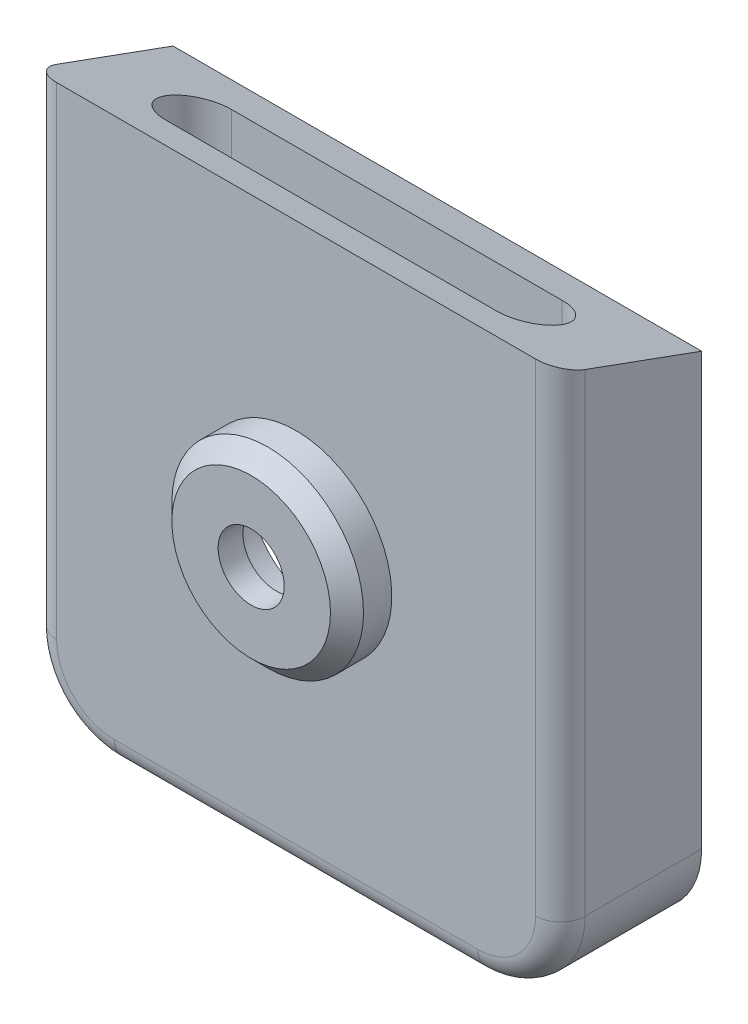
ISO-10303-21;
HEADER;
FILE_DESCRIPTION(('STEP AP214'),'2;1');
FILE_NAME('part.step','',(''),(''),'','','');
FILE_SCHEMA(('AUTOMOTIVE_DESIGN { 1 0 10303 214 1 1 1 1 }'));
ENDSEC;
DATA;
#1=APPLICATION_CONTEXT('core data for automotive mechanical design processes');
#2=APPLICATION_PROTOCOL_DEFINITION('international standard','automotive_design',2000,#1);
#3=PRODUCT_CONTEXT('',#1,'mechanical');
#4=PRODUCT('Part','Part','',(#3));
#5=PRODUCT_RELATED_PRODUCT_CATEGORY('part','',(#4));
#6=PRODUCT_DEFINITION_FORMATION('','',#4);
#7=PRODUCT_DEFINITION_CONTEXT('part definition',#1,'design');
#8=PRODUCT_DEFINITION('design','',#6,#7);
#9=PRODUCT_DEFINITION_SHAPE('','',#8);
#10=(LENGTH_UNIT() NAMED_UNIT(*) SI_UNIT(.MILLI.,.METRE.));
#11=(NAMED_UNIT(*) PLANE_ANGLE_UNIT() SI_UNIT($,.RADIAN.));
#12=(NAMED_UNIT(*) SI_UNIT($,.STERADIAN.) SOLID_ANGLE_UNIT());
#13=UNCERTAINTY_MEASURE_WITH_UNIT(LENGTH_MEASURE(1.E-05),#10,'distance_accuracy_value','');
#14=(GEOMETRIC_REPRESENTATION_CONTEXT(3) GLOBAL_UNCERTAINTY_ASSIGNED_CONTEXT((#13)) GLOBAL_UNIT_ASSIGNED_CONTEXT((#10,
#11,#12)) REPRESENTATION_CONTEXT('',''));
#15=CARTESIAN_POINT('',(0.,0.,0.));
#16=DIRECTION('',(0.,0.,1.));
#17=DIRECTION('',(1.,0.,0.));
#18=AXIS2_PLACEMENT_3D('',#15,#16,#17);
#19=CARTESIAN_POINT('',(0.,0.,0.));
#20=DIRECTION('',(0.,0.,-1.));
#21=DIRECTION('',(-1.,0.,0.));
#22=AXIS2_PLACEMENT_3D('',#19,#20,#21);
#23=PLANE('',#22);
#24=CARTESIAN_POINT('',(15.99167841418,17.4030955148981,0.));
#25=DIRECTION('',(0.,0.,-1.));
#26=DIRECTION('',(-1.,0.,0.));
#27=AXIS2_PLACEMENT_3D('',#24,#25,#26);
#28=CIRCLE('',#27,4.30000000001595);
#29=CARTESIAN_POINT('',(11.6916784141641,17.4030955148981,0.));
#30=VERTEX_POINT('',#29);
#31=EDGE_CURVE('E300',#30,#30,#28,.T.);
#32=ORIENTED_EDGE('',*,*,#31,.F.);
#33=EDGE_LOOP('',(#32));
#34=FACE_BOUND('',#33,.T.);
#35=DIRECTION('',(0.,1.,0.));
#36=VECTOR('',#35,1.);
#37=CARTESIAN_POINT('',(1.5,31.0919107027986,0.));
#38=LINE('',#37,#36);
#39=CARTESIAN_POINT('',(1.5,27.2919107027986,0.));
#40=VERTEX_POINT('',#39);
#41=CARTESIAN_POINT('',(1.5,5.,0.));
#42=VERTEX_POINT('',#41);
#43=EDGE_CURVE('E255',#40,#42,#38,.F.);
#44=ORIENTED_EDGE('',*,*,#43,.F.);
#45=CARTESIAN_POINT('',(3.5,27.2919107027986,0.));
#46=DIRECTION('',(0.,0.,-1.));
#47=DIRECTION('',(-1.,0.,0.));
#48=AXIS2_PLACEMENT_3D('',#45,#46,#47);
#49=CIRCLE('',#48,2.);
#50=CARTESIAN_POINT('',(3.5,29.2919107027986,0.));
#51=VERTEX_POINT('',#50);
#52=EDGE_CURVE('E326',#40,#51,#49,.T.);
#53=ORIENTED_EDGE('',*,*,#52,.T.);
#54=DIRECTION('',(-1.,0.,0.));
#55=VECTOR('',#54,1.);
#56=CARTESIAN_POINT('',(30.5,29.2919107027986,0.));
#57=LINE('',#56,#55);
#58=CARTESIAN_POINT('',(28.5,29.2919107027986,0.));
#59=VERTEX_POINT('',#58);
#60=EDGE_CURVE('E222',#59,#51,#57,.T.);
#61=ORIENTED_EDGE('',*,*,#60,.F.);
#62=CARTESIAN_POINT('',(28.5,27.2919107027986,0.));
#63=DIRECTION('',(0.,0.,-1.));
#64=DIRECTION('',(-1.,0.,0.));
#65=AXIS2_PLACEMENT_3D('',#62,#63,#64);
#66=CIRCLE('',#65,2.);
#67=CARTESIAN_POINT('',(30.5,27.2919107027986,0.));
#68=VERTEX_POINT('',#67);
#69=EDGE_CURVE('E324',#59,#68,#66,.T.);
#70=ORIENTED_EDGE('',*,*,#69,.T.);
#71=DIRECTION('',(0.,1.,0.));
#72=VECTOR('',#71,1.);
#73=CARTESIAN_POINT('',(30.5,5.,0.));
#74=LINE('',#73,#72);
#75=CARTESIAN_POINT('',(30.5,5.,0.));
#76=VERTEX_POINT('',#75);
#77=EDGE_CURVE('E240',#76,#68,#74,.T.);
#78=ORIENTED_EDGE('',*,*,#77,.F.);
#79=CARTESIAN_POINT('',(27.,5.,0.));
#80=DIRECTION('',(0.,0.,-1.));
#81=DIRECTION('',(-1.,0.,0.));
#82=AXIS2_PLACEMENT_3D('',#79,#80,#81);
#83=CIRCLE('',#82,3.5);
#84=CARTESIAN_POINT('',(27.,1.5,0.));
#85=VERTEX_POINT('',#84);
#86=EDGE_CURVE('E265',#85,#76,#83,.F.);
#87=ORIENTED_EDGE('',*,*,#86,.F.);
#88=DIRECTION('',(-1.,0.,0.));
#89=VECTOR('',#88,1.);
#90=CARTESIAN_POINT('',(5.,1.5,0.));
#91=LINE('',#90,#89);
#92=CARTESIAN_POINT('',(5.,1.5,0.));
#93=VERTEX_POINT('',#92);
#94=EDGE_CURVE('E270',#93,#85,#91,.F.);
#95=ORIENTED_EDGE('',*,*,#94,.F.);
#96=CARTESIAN_POINT('',(5.,5.,0.));
#97=DIRECTION('',(0.,0.,-1.));
#98=DIRECTION('',(-1.,0.,0.));
#99=AXIS2_PLACEMENT_3D('',#96,#97,#98);
#100=CIRCLE('',#99,3.5);
#101=EDGE_CURVE('E274',#42,#93,#100,.F.);
#102=ORIENTED_EDGE('',*,*,#101,.F.);
#103=EDGE_LOOP('',(#44,#53,#61,#70,#78,#87,#95,#102));
#104=FACE_BOUND('',#103,.T.);
#105=ADVANCED_FACE('F37',(#34,#104),#23,.T.);
#106=CARTESIAN_POINT('',(30.5,5.,-51.6673386829695));
#107=DIRECTION('',(1.,0.,0.));
#108=DIRECTION('',(0.,0.,-1.));
#109=AXIS2_PLACEMENT_3D('',#106,#107,#108);
#110=PLANE('',#109);
#111=ORIENTED_EDGE('',*,*,#77,.T.);
#112=DIRECTION('',(0.,0.,1.));
#113=VECTOR('',#112,1.);
#114=CARTESIAN_POINT('',(30.5,27.2919107027986,-7.05000000000003));
#115=LINE('',#114,#113);
#116=CARTESIAN_POINT('',(30.5,27.2919107027986,-7.05000000000003));
#117=VERTEX_POINT('',#116);
#118=EDGE_CURVE('E333',#68,#117,#115,.F.);
#119=ORIENTED_EDGE('',*,*,#118,.T.);
#120=DIRECTION('',(0.,1.,0.));
#121=VECTOR('',#120,1.);
#122=CARTESIAN_POINT('',(30.5,5.,-7.05000000000003));
#123=LINE('',#122,#121);
#124=CARTESIAN_POINT('',(30.5,4.99999999999989,-7.05000000000003));
#125=VERTEX_POINT('',#124);
#126=EDGE_CURVE('E268',#125,#117,#123,.T.);
#127=ORIENTED_EDGE('',*,*,#126,.F.);
#128=DIRECTION('',(0.,0.,1.));
#129=VECTOR('',#128,1.);
#130=CARTESIAN_POINT('',(30.5,5.,-51.6673386829695));
#131=LINE('',#130,#129);
#132=EDGE_CURVE('E235',#125,#76,#131,.T.);
#133=ORIENTED_EDGE('',*,*,#132,.T.);
#134=EDGE_LOOP('',(#111,#119,#127,#133));
#135=FACE_BOUND('',#134,.T.);
#136=ADVANCED_FACE('F432',(#135),#110,.F.);
#137=CARTESIAN_POINT('',(1.5,31.0919107027986,-51.6673386829695));
#138=DIRECTION('',(-1.,0.,0.));
#139=DIRECTION('',(0.,0.,1.));
#140=AXIS2_PLACEMENT_3D('',#137,#138,#139);
#141=PLANE('',#140);
#142=DIRECTION('',(0.,-1.,0.));
#143=VECTOR('',#142,1.);
#144=CARTESIAN_POINT('',(1.5,31.0919107027986,-7.05000000000003));
#145=LINE('',#144,#143);
#146=CARTESIAN_POINT('',(1.5,27.2919107027986,-7.05000000000003));
#147=VERTEX_POINT('',#146);
#148=CARTESIAN_POINT('',(1.50000000000003,4.99999999999989,-7.05000000000003));
#149=VERTEX_POINT('',#148);
#150=EDGE_CURVE('E259',#147,#149,#145,.T.);
#151=ORIENTED_EDGE('',*,*,#150,.F.);
#152=DIRECTION('',(0.,0.,1.));
#153=VECTOR('',#152,1.);
#154=CARTESIAN_POINT('',(1.5,27.2919107027986,0.));
#155=LINE('',#154,#153);
#156=EDGE_CURVE('E321',#147,#40,#155,.T.);
#157=ORIENTED_EDGE('',*,*,#156,.T.);
#158=ORIENTED_EDGE('',*,*,#43,.T.);
#159=DIRECTION('',(0.,0.,1.));
#160=VECTOR('',#159,1.);
#161=CARTESIAN_POINT('',(1.5,5.,-51.6673386829695));
#162=LINE('',#161,#160);
#163=EDGE_CURVE('E277',#149,#42,#162,.T.);
#164=ORIENTED_EDGE('',*,*,#163,.F.);
#165=EDGE_LOOP('',(#151,#157,#158,#164));
#166=FACE_BOUND('',#165,.T.);
#167=ADVANCED_FACE('F428',(#166),#141,.F.);
#168=CARTESIAN_POINT('',(0.,0.,1.5));
#169=DIRECTION('',(0.,0.,-1.));
#170=DIRECTION('',(-1.,0.,0.));
#171=AXIS2_PLACEMENT_3D('',#168,#169,#170);
#172=PLANE('',#171);
#173=DIRECTION('',(1.,0.,0.));
#174=VECTOR('',#173,1.);
#175=CARTESIAN_POINT('',(-9.09871995466946,34.2038562057746,1.5));
#176=LINE('',#175,#174);
#177=CARTESIAN_POINT('',(1.5,34.2038562057746,1.5));
#178=VERTEX_POINT('',#177);
#179=CARTESIAN_POINT('',(30.5,34.2038562057746,1.5));
#180=VERTEX_POINT('',#179);
#181=EDGE_CURVE('E230',#178,#180,#176,.T.);
#182=ORIENTED_EDGE('',*,*,#181,.F.);
#183=DIRECTION('',(0.,-1.,0.));
#184=VECTOR('',#183,1.);
#185=CARTESIAN_POINT('',(1.5,0.,1.5));
#186=LINE('',#185,#184);
#187=CARTESIAN_POINT('',(1.5,5.,1.5));
#188=VERTEX_POINT('',#187);
#189=EDGE_CURVE('E347',#178,#188,#186,.T.);
#190=ORIENTED_EDGE('',*,*,#189,.T.);
#191=CARTESIAN_POINT('',(5.,5.,1.5));
#192=DIRECTION('',(0.,0.,-1.));
#193=DIRECTION('',(-1.,0.,0.));
#194=AXIS2_PLACEMENT_3D('',#191,#192,#193);
#195=CIRCLE('',#194,3.5);
#196=CARTESIAN_POINT('',(5.,1.5,1.5));
#197=VERTEX_POINT('',#196);
#198=EDGE_CURVE('E345',#188,#197,#195,.F.);
#199=ORIENTED_EDGE('',*,*,#198,.T.);
#200=DIRECTION('',(1.,0.,0.));
#201=VECTOR('',#200,1.);
#202=CARTESIAN_POINT('',(0.,1.5,1.5));
#203=LINE('',#202,#201);
#204=CARTESIAN_POINT('',(27.,1.5,1.5));
#205=VERTEX_POINT('',#204);
#206=EDGE_CURVE('E343',#197,#205,#203,.T.);
#207=ORIENTED_EDGE('',*,*,#206,.T.);
#208=CARTESIAN_POINT('',(27.,5.,1.5));
#209=DIRECTION('',(0.,0.,-1.));
#210=DIRECTION('',(-1.,0.,0.));
#211=AXIS2_PLACEMENT_3D('',#208,#209,#210);
#212=CIRCLE('',#211,3.5);
#213=CARTESIAN_POINT('',(30.5,5.,1.5));
#214=VERTEX_POINT('',#213);
#215=EDGE_CURVE('E341',#205,#214,#212,.F.);
#216=ORIENTED_EDGE('',*,*,#215,.T.);
#217=DIRECTION('',(0.,1.,0.));
#218=VECTOR('',#217,1.);
#219=CARTESIAN_POINT('',(30.5,0.,1.5));
#220=LINE('',#219,#218);
#221=EDGE_CURVE('E339',#214,#180,#220,.T.);
#222=ORIENTED_EDGE('',*,*,#221,.T.);
#223=EDGE_LOOP('',(#182,#190,#199,#207,#216,#222));
#224=FACE_BOUND('',#223,.T.);
#225=CARTESIAN_POINT('',(15.99167841418,17.4030955148981,1.5));
#226=DIRECTION('',(0.,0.,-1.));
#227=DIRECTION('',(-1.,0.,0.));
#228=AXIS2_PLACEMENT_3D('',#225,#226,#227);
#229=CIRCLE('',#228,5.79999999998862);
#230=CARTESIAN_POINT('',(10.1916784141914,17.4030955148981,1.5));
#231=VERTEX_POINT('',#230);
#232=EDGE_CURVE('E312',#231,#231,#229,.F.);
#233=ORIENTED_EDGE('',*,*,#232,.F.);
#234=EDGE_LOOP('',(#233));
#235=FACE_BOUND('',#234,.T.);
#236=ADVANCED_FACE('F401',(#224,#235),#172,.F.);
#237=CARTESIAN_POINT('',(0.,0.,1.5));
#238=DIRECTION('',(1.,0.,0.));
#239=DIRECTION('',(0.,0.,-1.));
#240=AXIS2_PLACEMENT_3D('',#237,#238,#239);
#241=PLANE('',#240);
#242=DIRECTION('',(0.,0.,-1.));
#243=VECTOR('',#242,1.);
#244=CARTESIAN_POINT('',(0.,5.,1.5));
#245=LINE('',#244,#243);
#246=CARTESIAN_POINT('',(0.,4.99999999999989,-7.05000000000003));
#247=VERTEX_POINT('',#246);
#248=CARTESIAN_POINT('',(0.,5.,0.));
#249=VERTEX_POINT('',#248);
#250=EDGE_CURVE('E309',#247,#249,#245,.F.);
#251=ORIENTED_EDGE('',*,*,#250,.T.);
#252=DIRECTION('',(0.,-1.,0.));
#253=VECTOR('',#252,1.);
#254=CARTESIAN_POINT('',(0.,0.,0.));
#255=LINE('',#254,#253);
#256=CARTESIAN_POINT('',(0.,33.6579008543753,0.));
#257=VERTEX_POINT('',#256);
#258=EDGE_CURVE('E350',#249,#257,#255,.F.);
#259=ORIENTED_EDGE('',*,*,#258,.T.);
#260=DIRECTION('',(0.,-0.342020143325631,-0.939692620785922));
#261=VECTOR('',#260,1.);
#262=CARTESIAN_POINT('',(0.,31.0919107027987,-7.05000000000045));
#263=LINE('',#262,#261);
#264=CARTESIAN_POINT('',(0.,31.0919107027987,-7.05000000000045));
#265=VERTEX_POINT('',#264);
#266=EDGE_CURVE('E233',#257,#265,#263,.T.);
#267=ORIENTED_EDGE('',*,*,#266,.T.);
#268=DIRECTION('',(0.,-1.,0.));
#269=VECTOR('',#268,1.);
#270=CARTESIAN_POINT('',(0.,31.0919107027986,-7.05000000000003));
#271=LINE('',#270,#269);
#272=EDGE_CURVE('E252',#265,#247,#271,.T.);
#273=ORIENTED_EDGE('',*,*,#272,.T.);
#274=EDGE_LOOP('',(#251,#259,#267,#273));
#275=FACE_BOUND('',#274,.T.);
#276=ADVANCED_FACE('F419',(#275),#241,.F.);
#277=CARTESIAN_POINT('',(0.,0.,1.5));
#278=DIRECTION('',(0.,1.,0.));
#279=DIRECTION('',(0.,0.,1.));
#280=AXIS2_PLACEMENT_3D('',#277,#278,#279);
#281=PLANE('',#280);
#282=DIRECTION('',(0.,0.,-1.));
#283=VECTOR('',#282,1.);
#284=CARTESIAN_POINT('',(27.,0.,1.5));
#285=LINE('',#284,#283);
#286=CARTESIAN_POINT('',(27.,-1.11022302462516E-13,-7.05000000000003));
#287=VERTEX_POINT('',#286);
#288=CARTESIAN_POINT('',(27.,0.,0.));
#289=VERTEX_POINT('',#288);
#290=EDGE_CURVE('E307',#287,#289,#285,.F.);
#291=ORIENTED_EDGE('',*,*,#290,.T.);
#292=DIRECTION('',(1.,0.,0.));
#293=VECTOR('',#292,1.);
#294=CARTESIAN_POINT('',(0.,0.,0.));
#295=LINE('',#294,#293);
#296=CARTESIAN_POINT('',(5.,0.,0.));
#297=VERTEX_POINT('',#296);
#298=EDGE_CURVE('E358',#289,#297,#295,.F.);
#299=ORIENTED_EDGE('',*,*,#298,.T.);
#300=DIRECTION('',(0.,0.,-1.));
#301=VECTOR('',#300,1.);
#302=CARTESIAN_POINT('',(5.,0.,1.5));
#303=LINE('',#302,#301);
#304=CARTESIAN_POINT('',(5.00000000000003,-1.11022302462516E-13,-7.05000000000003));
#305=VERTEX_POINT('',#304);
#306=EDGE_CURVE('E305',#297,#305,#303,.T.);
#307=ORIENTED_EDGE('',*,*,#306,.T.);
#308=DIRECTION('',(1.,0.,0.));
#309=VECTOR('',#308,1.);
#310=CARTESIAN_POINT('',(5.,0.,-7.05000000000003));
#311=LINE('',#310,#309);
#312=EDGE_CURVE('E246',#305,#287,#311,.T.);
#313=ORIENTED_EDGE('',*,*,#312,.T.);
#314=EDGE_LOOP('',(#291,#299,#307,#313));
#315=FACE_BOUND('',#314,.T.);
#316=ADVANCED_FACE('F412',(#315),#281,.F.);
#317=CARTESIAN_POINT('',(32.,0.,1.5));
#318=DIRECTION('',(-1.,0.,0.));
#319=DIRECTION('',(0.,0.,1.));
#320=AXIS2_PLACEMENT_3D('',#317,#318,#319);
#321=PLANE('',#320);
#322=DIRECTION('',(0.,0.342020143325631,0.939692620785922));
#323=VECTOR('',#322,1.);
#324=CARTESIAN_POINT('',(32.,31.0919107027987,-7.05000000000045));
#325=LINE('',#324,#323);
#326=CARTESIAN_POINT('',(32.,31.0919107027987,-7.05000000000045));
#327=VERTEX_POINT('',#326);
#328=CARTESIAN_POINT('',(32.,33.6579008543753,0.));
#329=VERTEX_POINT('',#328);
#330=EDGE_CURVE('E228',#327,#329,#325,.T.);
#331=ORIENTED_EDGE('',*,*,#330,.T.);
#332=DIRECTION('',(0.,1.,0.));
#333=VECTOR('',#332,1.);
#334=CARTESIAN_POINT('',(32.,0.,0.));
#335=LINE('',#334,#333);
#336=CARTESIAN_POINT('',(32.,5.,0.));
#337=VERTEX_POINT('',#336);
#338=EDGE_CURVE('E11',#329,#337,#335,.F.);
#339=ORIENTED_EDGE('',*,*,#338,.T.);
#340=DIRECTION('',(0.,0.,-1.));
#341=VECTOR('',#340,1.);
#342=CARTESIAN_POINT('',(32.,5.,1.5));
#343=LINE('',#342,#341);
#344=CARTESIAN_POINT('',(32.,4.99999999999989,-7.05000000000003));
#345=VERTEX_POINT('',#344);
#346=EDGE_CURVE('E303',#337,#345,#343,.T.);
#347=ORIENTED_EDGE('',*,*,#346,.T.);
#348=DIRECTION('',(0.,1.,0.));
#349=VECTOR('',#348,1.);
#350=CARTESIAN_POINT('',(32.,5.,-7.05000000000003));
#351=LINE('',#350,#349);
#352=EDGE_CURVE('E239',#345,#327,#351,.T.);
#353=ORIENTED_EDGE('',*,*,#352,.T.);
#354=EDGE_LOOP('',(#331,#339,#347,#353));
#355=FACE_BOUND('',#354,.T.);
#356=ADVANCED_FACE('F426',(#355),#321,.F.);
#357=CARTESIAN_POINT('',(27.,5.,1.5));
#358=DIRECTION('',(0.,0.,-1.));
#359=DIRECTION('',(-1.,0.,0.));
#360=AXIS2_PLACEMENT_3D('',#357,#358,#359);
#361=CYLINDRICAL_SURFACE('',#360,5.);
#362=ORIENTED_EDGE('',*,*,#346,.F.);
#363=CARTESIAN_POINT('',(27.,5.,0.));
#364=DIRECTION('',(0.,0.,-1.));
#365=DIRECTION('',(-1.,0.,0.));
#366=AXIS2_PLACEMENT_3D('',#363,#364,#365);
#367=CIRCLE('',#366,5.);
#368=EDGE_CURVE('E46',#337,#289,#367,.T.);
#369=ORIENTED_EDGE('',*,*,#368,.T.);
#370=ORIENTED_EDGE('',*,*,#290,.F.);
#371=CARTESIAN_POINT('',(27.,5.,-7.05000000000003));
#372=DIRECTION('',(0.,0.,-1.));
#373=DIRECTION('',(-1.,0.,0.));
#374=AXIS2_PLACEMENT_3D('',#371,#372,#373);
#375=CIRCLE('',#374,5.);
#376=EDGE_CURVE('E243',#287,#345,#375,.F.);
#377=ORIENTED_EDGE('',*,*,#376,.T.);
#378=EDGE_LOOP('',(#362,#369,#370,#377));
#379=FACE_BOUND('',#378,.T.);
#380=ADVANCED_FACE('F445',(#379),#361,.T.);
#381=CARTESIAN_POINT('',(5.,5.,1.5));
#382=DIRECTION('',(0.,0.,-1.));
#383=DIRECTION('',(-1.,0.,0.));
#384=AXIS2_PLACEMENT_3D('',#381,#382,#383);
#385=CYLINDRICAL_SURFACE('',#384,5.);
#386=ORIENTED_EDGE('',*,*,#306,.F.);
#387=CARTESIAN_POINT('',(5.,5.,0.));
#388=DIRECTION('',(0.,0.,-1.));
#389=DIRECTION('',(-1.,0.,0.));
#390=AXIS2_PLACEMENT_3D('',#387,#388,#389);
#391=CIRCLE('',#390,5.);
#392=EDGE_CURVE('E356',#297,#249,#391,.T.);
#393=ORIENTED_EDGE('',*,*,#392,.T.);
#394=ORIENTED_EDGE('',*,*,#250,.F.);
#395=CARTESIAN_POINT('',(5.,5.,-7.05000000000003));
#396=DIRECTION('',(0.,0.,-1.));
#397=DIRECTION('',(-1.,0.,0.));
#398=AXIS2_PLACEMENT_3D('',#395,#396,#397);
#399=CIRCLE('',#398,5.);
#400=EDGE_CURVE('E249',#247,#305,#399,.F.);
#401=ORIENTED_EDGE('',*,*,#400,.T.);
#402=EDGE_LOOP('',(#386,#393,#394,#401));
#403=FACE_BOUND('',#402,.T.);
#404=ADVANCED_FACE('F415',(#403),#385,.T.);
#405=CARTESIAN_POINT('',(15.99167841418,17.4030955148981,1.5));
#406=DIRECTION('',(0.,0.,-1.));
#407=DIRECTION('',(-1.,0.,0.));
#408=AXIS2_PLACEMENT_3D('',#405,#406,#407);
#409=CYLINDRICAL_SURFACE('',#408,4.30000000001595);
#410=ORIENTED_EDGE('',*,*,#31,.T.);
#411=EDGE_LOOP('',(#410));
#412=FACE_BOUND('',#411,.T.);
#413=CARTESIAN_POINT('',(15.99167841418,17.4030955148981,2.7129998678795));
#414=DIRECTION('',(0.,0.,-1.));
#415=DIRECTION('',(-1.,0.,0.));
#416=AXIS2_PLACEMENT_3D('',#413,#414,#415);
#417=CIRCLE('',#416,4.29999999999419);
#418=CARTESIAN_POINT('',(11.6916784141858,17.4030955148981,2.7129998678795));
#419=VERTEX_POINT('',#418);
#420=EDGE_CURVE('E295',#419,#419,#417,.T.);
#421=ORIENTED_EDGE('',*,*,#420,.F.);
#422=EDGE_LOOP('',(#421));
#423=FACE_BOUND('',#422,.T.);
#424=ADVANCED_FACE('F453',(#412,#423),#409,.F.);
#425=CARTESIAN_POINT('',(15.99167841418,17.4030955148981,19.1178771913752));
#426=DIRECTION('',(0.,0.,-1.));
#427=DIRECTION('',(-1.,0.,0.));
#428=AXIS2_PLACEMENT_3D('',#425,#426,#427);
#429=CYLINDRICAL_SURFACE('',#428,5.79999999998862);
#430=CARTESIAN_POINT('',(15.99167841418,17.4030955148981,3.21299986788507));
#431=DIRECTION('',(0.,0.,1.));
#432=DIRECTION('',(1.,0.,0.));
#433=AXIS2_PLACEMENT_3D('',#430,#431,#432);
#434=CIRCLE('',#433,5.79999999998862);
#435=CARTESIAN_POINT('',(21.7916784141686,17.4030955148981,3.21299986788507));
#436=VERTEX_POINT('',#435);
#437=EDGE_CURVE('E318',#436,#436,#434,.F.);
#438=ORIENTED_EDGE('',*,*,#437,.T.);
#439=EDGE_LOOP('',(#438));
#440=FACE_BOUND('',#439,.T.);
#441=ORIENTED_EDGE('',*,*,#232,.T.);
#442=EDGE_LOOP('',(#441));
#443=FACE_BOUND('',#442,.T.);
#444=ADVANCED_FACE('F522',(#440,#443),#429,.T.);
#445=CARTESIAN_POINT('',(15.99167841418,17.4030955148981,2.7129998678795));
#446=DIRECTION('',(0.,0.,1.));
#447=DIRECTION('',(1.,0.,0.));
#448=AXIS2_PLACEMENT_3D('',#445,#446,#447);
#449=PLANE('',#448);
#450=CARTESIAN_POINT('',(15.99167841418,17.4030955148981,2.7129998678795));
#451=DIRECTION('',(0.,0.,1.));
#452=DIRECTION('',(1.,0.,0.));
#453=AXIS2_PLACEMENT_3D('',#450,#451,#452);
#454=CIRCLE('',#453,1.99999999999419);
#455=CARTESIAN_POINT('',(17.9916784141742,17.4030955148981,2.7129998678795));
#456=VERTEX_POINT('',#455);
#457=EDGE_CURVE('E264',#456,#456,#454,.T.);
#458=ORIENTED_EDGE('',*,*,#457,.T.);
#459=EDGE_LOOP('',(#458));
#460=FACE_BOUND('',#459,.T.);
#461=ORIENTED_EDGE('',*,*,#420,.T.);
#462=EDGE_LOOP('',(#461));
#463=FACE_BOUND('',#462,.T.);
#464=ADVANCED_FACE('F518',(#460,#463),#449,.F.);
#465=CARTESIAN_POINT('',(15.99167841418,17.4030955148981,4.2129998678795));
#466=DIRECTION('',(0.,0.,1.));
#467=DIRECTION('',(1.,0.,0.));
#468=AXIS2_PLACEMENT_3D('',#465,#466,#467);
#469=PLANE('',#468);
#470=CARTESIAN_POINT('',(15.99167841418,17.4030955148981,4.2129998678795));
#471=DIRECTION('',(0.,0.,1.));
#472=DIRECTION('',(1.,0.,0.));
#473=AXIS2_PLACEMENT_3D('',#470,#471,#472);
#474=CIRCLE('',#473,4.79999999999419);
#475=CARTESIAN_POINT('',(20.7916784141742,17.4030955148981,4.2129998678795));
#476=VERTEX_POINT('',#475);
#477=EDGE_CURVE('E315',#476,#476,#474,.T.);
#478=ORIENTED_EDGE('',*,*,#477,.T.);
#479=EDGE_LOOP('',(#478));
#480=FACE_BOUND('',#479,.T.);
#481=CARTESIAN_POINT('',(15.99167841418,17.4030955148981,4.2129998678795));
#482=DIRECTION('',(0.,0.,1.));
#483=DIRECTION('',(1.,0.,0.));
#484=AXIS2_PLACEMENT_3D('',#481,#482,#483);
#485=CIRCLE('',#484,1.99999999999419);
#486=CARTESIAN_POINT('',(17.9916784141742,17.4030955148981,4.2129998678795));
#487=VERTEX_POINT('',#486);
#488=EDGE_CURVE('E292',#487,#487,#485,.T.);
#489=ORIENTED_EDGE('',*,*,#488,.F.);
#490=EDGE_LOOP('',(#489));
#491=FACE_BOUND('',#490,.T.);
#492=ADVANCED_FACE('F514',(#480,#491),#469,.T.);
#493=CARTESIAN_POINT('',(15.99167841418,17.4030955148981,4.2129998678795));
#494=DIRECTION('',(0.,0.,-1.));
#495=DIRECTION('',(-1.,0.,0.));
#496=AXIS2_PLACEMENT_3D('',#493,#494,#495);
#497=CYLINDRICAL_SURFACE('',#496,1.99999999999419);
#498=ORIENTED_EDGE('',*,*,#488,.T.);
#499=EDGE_LOOP('',(#498));
#500=FACE_BOUND('',#499,.T.);
#501=ORIENTED_EDGE('',*,*,#457,.F.);
#502=EDGE_LOOP('',(#501));
#503=FACE_BOUND('',#502,.T.);
#504=ADVANCED_FACE('F460',(#500,#503),#497,.F.);
#505=CARTESIAN_POINT('',(15.99167841418,17.4030955148981,4.2129998678795));
#506=DIRECTION('',(0.,0.,-1.));
#507=DIRECTION('',(-1.,0.,0.));
#508=AXIS2_PLACEMENT_3D('',#505,#506,#507);
#509=CONICAL_SURFACE('',#508,4.79999999999419,0.78539816339745);
#510=ORIENTED_EDGE('',*,*,#437,.F.);
#511=EDGE_LOOP('',(#510));
#512=FACE_BOUND('',#511,.T.);
#513=ORIENTED_EDGE('',*,*,#477,.F.);
#514=EDGE_LOOP('',(#513));
#515=FACE_BOUND('',#514,.T.);
#516=ADVANCED_FACE('F456',(#512,#515),#509,.T.);
#517=CARTESIAN_POINT('',(5.,5.,-51.6673386829695));
#518=DIRECTION('',(0.,0.,1.));
#519=DIRECTION('',(1.,0.,0.));
#520=AXIS2_PLACEMENT_3D('',#517,#518,#519);
#521=CYLINDRICAL_SURFACE('',#520,3.5);
#522=CARTESIAN_POINT('',(5.,5.,-7.05000000000003));
#523=DIRECTION('',(0.,0.,-1.));
#524=DIRECTION('',(-1.,0.,0.));
#525=AXIS2_PLACEMENT_3D('',#522,#523,#524);
#526=CIRCLE('',#525,3.5);
#527=CARTESIAN_POINT('',(5.00000000000003,1.49999999999989,-7.05000000000003));
#528=VERTEX_POINT('',#527);
#529=EDGE_CURVE('E256',#149,#528,#526,.F.);
#530=ORIENTED_EDGE('',*,*,#529,.F.);
#531=ORIENTED_EDGE('',*,*,#163,.T.);
#532=ORIENTED_EDGE('',*,*,#101,.T.);
#533=DIRECTION('',(0.,0.,1.));
#534=VECTOR('',#533,1.);
#535=CARTESIAN_POINT('',(5.,1.5,-51.6673386829695));
#536=LINE('',#535,#534);
#537=EDGE_CURVE('E273',#528,#93,#536,.T.);
#538=ORIENTED_EDGE('',*,*,#537,.F.);
#539=EDGE_LOOP('',(#530,#531,#532,#538));
#540=FACE_BOUND('',#539,.T.);
#541=ADVANCED_FACE('F459',(#540),#521,.F.);
#542=CARTESIAN_POINT('',(5.,1.5,-51.6673386829695));
#543=DIRECTION('',(0.,-1.,0.));
#544=DIRECTION('',(0.,0.,-1.));
#545=AXIS2_PLACEMENT_3D('',#542,#543,#544);
#546=PLANE('',#545);
#547=DIRECTION('',(1.,0.,0.));
#548=VECTOR('',#547,1.);
#549=CARTESIAN_POINT('',(5.,1.5,-7.05000000000003));
#550=LINE('',#549,#548);
#551=CARTESIAN_POINT('',(27.,1.5,-7.05000000000003));
#552=VERTEX_POINT('',#551);
#553=EDGE_CURVE('E258',#528,#552,#550,.T.);
#554=ORIENTED_EDGE('',*,*,#553,.F.);
#555=ORIENTED_EDGE('',*,*,#537,.T.);
#556=ORIENTED_EDGE('',*,*,#94,.T.);
#557=DIRECTION('',(0.,0.,1.));
#558=VECTOR('',#557,1.);
#559=CARTESIAN_POINT('',(27.,1.5,-51.6673386829695));
#560=LINE('',#559,#558);
#561=EDGE_CURVE('E269',#552,#85,#560,.T.);
#562=ORIENTED_EDGE('',*,*,#561,.F.);
#563=EDGE_LOOP('',(#554,#555,#556,#562));
#564=FACE_BOUND('',#563,.T.);
#565=ADVANCED_FACE('F498',(#564),#546,.F.);
#566=CARTESIAN_POINT('',(27.,5.,-51.6673386829695));
#567=DIRECTION('',(0.,0.,1.));
#568=DIRECTION('',(1.,0.,0.));
#569=AXIS2_PLACEMENT_3D('',#566,#567,#568);
#570=CYLINDRICAL_SURFACE('',#569,3.5);
#571=CARTESIAN_POINT('',(27.,5.,-7.05000000000003));
#572=DIRECTION('',(0.,0.,-1.));
#573=DIRECTION('',(-1.,0.,0.));
#574=AXIS2_PLACEMENT_3D('',#571,#572,#573);
#575=CIRCLE('',#574,3.5);
#576=EDGE_CURVE('E261',#552,#125,#575,.F.);
#577=ORIENTED_EDGE('',*,*,#576,.F.);
#578=ORIENTED_EDGE('',*,*,#561,.T.);
#579=ORIENTED_EDGE('',*,*,#86,.T.);
#580=ORIENTED_EDGE('',*,*,#132,.F.);
#581=EDGE_LOOP('',(#577,#578,#579,#580));
#582=FACE_BOUND('',#581,.T.);
#583=ADVANCED_FACE('F495',(#582),#570,.F.);
#584=CARTESIAN_POINT('',(32.,29.9999999999999,-7.05000000000003));
#585=DIRECTION('',(0.,0.,-1.));
#586=DIRECTION('',(1.,0.,0.));
#587=AXIS2_PLACEMENT_3D('',#584,#585,#586);
#588=PLANE('',#587);
#589=ORIENTED_EDGE('',*,*,#126,.T.);
#590=CARTESIAN_POINT('',(28.5,27.2919107027986,-7.05000000000003));
#591=DIRECTION('',(0.,0.,-1.));
#592=DIRECTION('',(-1.,0.,0.));
#593=AXIS2_PLACEMENT_3D('',#590,#591,#592);
#594=CIRCLE('',#593,2.);
#595=CARTESIAN_POINT('',(28.5,29.2919107027986,-7.05000000000003));
#596=VERTEX_POINT('',#595);
#597=EDGE_CURVE('E337',#117,#596,#594,.F.);
#598=ORIENTED_EDGE('',*,*,#597,.T.);
#599=DIRECTION('',(-1.,0.,0.));
#600=VECTOR('',#599,1.);
#601=CARTESIAN_POINT('',(30.5,29.2919107027986,-7.05000000000003));
#602=LINE('',#601,#600);
#603=CARTESIAN_POINT('',(3.5,29.2919107027986,-7.05000000000003));
#604=VERTEX_POINT('',#603);
#605=EDGE_CURVE('E225',#596,#604,#602,.T.);
#606=ORIENTED_EDGE('',*,*,#605,.T.);
#607=CARTESIAN_POINT('',(3.5,27.2919107027986,-7.05000000000003));
#608=DIRECTION('',(0.,0.,-1.));
#609=DIRECTION('',(-1.,0.,0.));
#610=AXIS2_PLACEMENT_3D('',#607,#608,#609);
#611=CIRCLE('',#610,2.);
#612=EDGE_CURVE('E335',#604,#147,#611,.F.);
#613=ORIENTED_EDGE('',*,*,#612,.T.);
#614=ORIENTED_EDGE('',*,*,#150,.T.);
#615=ORIENTED_EDGE('',*,*,#529,.T.);
#616=ORIENTED_EDGE('',*,*,#553,.T.);
#617=ORIENTED_EDGE('',*,*,#576,.T.);
#618=EDGE_LOOP('',(#589,#598,#606,#613,#614,#615,#616,#617));
#619=FACE_BOUND('',#618,.T.);
#620=ORIENTED_EDGE('',*,*,#272,.F.);
#621=DIRECTION('',(-1.,0.,0.));
#622=VECTOR('',#621,1.);
#623=CARTESIAN_POINT('',(32.,31.0919107027986,-7.05000000000003));
#624=LINE('',#623,#622);
#625=EDGE_CURVE('E236',#327,#265,#624,.T.);
#626=ORIENTED_EDGE('',*,*,#625,.F.);
#627=ORIENTED_EDGE('',*,*,#352,.F.);
#628=ORIENTED_EDGE('',*,*,#376,.F.);
#629=ORIENTED_EDGE('',*,*,#312,.F.);
#630=ORIENTED_EDGE('',*,*,#400,.F.);
#631=EDGE_LOOP('',(#620,#626,#627,#628,#629,#630));
#632=FACE_BOUND('',#631,.T.);
#633=ADVANCED_FACE('F386',(#619,#632),#588,.T.);
#634=CARTESIAN_POINT('',(-9.09871995466946,31.0919107027987,-7.05000000000045));
#635=DIRECTION('',(0.,0.939692620785922,-0.342020143325631));
#636=DIRECTION('',(0.,0.342020143325631,0.939692620785922));
#637=AXIS2_PLACEMENT_3D('',#634,#635,#636);
#638=PLANE('',#637);
#639=CARTESIAN_POINT('',(26.,32.7115782452833,-2.6));
#640=DIRECTION('',(0.,0.939692620785922,-0.342020143325631));
#641=DIRECTION('',(0.,-0.342020143325631,-0.939692620785922));
#642=AXIS2_PLACEMENT_3D('',#639,#640,#641);
#643=ELLIPSE('',#642,2.12835554495179,2.);
#644=CARTESIAN_POINT('',(26.,33.4395187138156,-0.6));
#645=VERTEX_POINT('',#644);
#646=CARTESIAN_POINT('',(26.,31.983637776751,-4.6));
#647=VERTEX_POINT('',#646);
#648=EDGE_CURVE('E220',#645,#647,#643,.T.);
#649=ORIENTED_EDGE('',*,*,#648,.F.);
#650=DIRECTION('',(1.,0.,0.));
#651=VECTOR('',#650,1.);
#652=CARTESIAN_POINT('',(-9.09871995466946,33.4395187138156,-0.600000000000004));
#653=LINE('',#652,#651);
#654=CARTESIAN_POINT('',(6.,33.4395187138156,-0.600000000000002));
#655=VERTEX_POINT('',#654);
#656=EDGE_CURVE('E213',#655,#645,#653,.T.);
#657=ORIENTED_EDGE('',*,*,#656,.F.);
#658=CARTESIAN_POINT('',(6.,32.7115782452833,-2.6));
#659=DIRECTION('',(0.,0.939692620785922,-0.342020143325631));
#660=DIRECTION('',(0.,-0.342020143325631,-0.939692620785922));
#661=AXIS2_PLACEMENT_3D('',#658,#659,#660);
#662=ELLIPSE('',#661,2.12835554495179,2.);
#663=CARTESIAN_POINT('',(6.,31.983637776751,-4.6));
#664=VERTEX_POINT('',#663);
#665=EDGE_CURVE('E188',#664,#655,#662,.T.);
#666=ORIENTED_EDGE('',*,*,#665,.F.);
#667=DIRECTION('',(-1.,0.,0.));
#668=VECTOR('',#667,1.);
#669=CARTESIAN_POINT('',(-9.09871995466946,31.983637776751,-4.60000000000001));
#670=LINE('',#669,#668);
#671=EDGE_CURVE('E218',#647,#664,#670,.T.);
#672=ORIENTED_EDGE('',*,*,#671,.F.);
#673=EDGE_LOOP('',(#649,#657,#666,#672));
#674=FACE_BOUND('',#673,.T.);
#675=ORIENTED_EDGE('',*,*,#266,.F.);
#676=CARTESIAN_POINT('',(1.5,33.6579008543753,0.));
#677=DIRECTION('',(0.,0.939692620785922,-0.342020143325631));
#678=DIRECTION('',(0.,-0.342020143325631,-0.939692620785922));
#679=AXIS2_PLACEMENT_3D('',#676,#677,#678);
#680=ELLIPSE('',#679,1.59626665871384,1.5);
#681=EDGE_CURVE('E354',#257,#178,#680,.T.);
#682=ORIENTED_EDGE('',*,*,#681,.T.);
#683=ORIENTED_EDGE('',*,*,#181,.T.);
#684=CARTESIAN_POINT('',(30.5,33.6579008543753,0.));
#685=DIRECTION('',(0.,0.939692620785922,-0.342020143325631));
#686=DIRECTION('',(0.,0.342020143325631,0.939692620785922));
#687=AXIS2_PLACEMENT_3D('',#684,#685,#686);
#688=ELLIPSE('',#687,1.59626665871384,1.5);
#689=EDGE_CURVE('E352',#180,#329,#688,.T.);
#690=ORIENTED_EDGE('',*,*,#689,.T.);
#691=ORIENTED_EDGE('',*,*,#330,.F.);
#692=ORIENTED_EDGE('',*,*,#625,.T.);
#693=EDGE_LOOP('',(#675,#682,#683,#690,#691,#692));
#694=FACE_BOUND('',#693,.T.);
#695=ADVANCED_FACE('F383',(#674,#694),#638,.T.);
#696=CARTESIAN_POINT('',(30.5,29.2919107027986,-36.1058083694122));
#697=DIRECTION('',(0.,1.,0.));
#698=DIRECTION('',(0.,0.,1.));
#699=AXIS2_PLACEMENT_3D('',#696,#697,#698);
#700=PLANE('',#699);
#701=DIRECTION('',(-1.,0.,0.));
#702=VECTOR('',#701,1.);
#703=CARTESIAN_POINT('',(26.,29.2919107027986,-0.6));
#704=LINE('',#703,#702);
#705=CARTESIAN_POINT('',(26.,29.2919107027986,-0.600000000000004));
#706=VERTEX_POINT('',#705);
#707=CARTESIAN_POINT('',(6.,29.2919107027986,-0.600000000000004));
#708=VERTEX_POINT('',#707);
#709=EDGE_CURVE('E196',#706,#708,#704,.T.);
#710=ORIENTED_EDGE('',*,*,#709,.F.);
#711=CARTESIAN_POINT('',(26.,29.2919107027986,-2.6));
#712=DIRECTION('',(0.,-1.,0.));
#713=DIRECTION('',(0.,0.,-1.));
#714=AXIS2_PLACEMENT_3D('',#711,#712,#713);
#715=CIRCLE('',#714,2.);
#716=CARTESIAN_POINT('',(26.,29.2919107027986,-4.6));
#717=VERTEX_POINT('',#716);
#718=EDGE_CURVE('E201',#717,#706,#715,.T.);
#719=ORIENTED_EDGE('',*,*,#718,.F.);
#720=DIRECTION('',(1.,0.,0.));
#721=VECTOR('',#720,1.);
#722=CARTESIAN_POINT('',(26.,29.2919107027986,-4.6));
#723=LINE('',#722,#721);
#724=CARTESIAN_POINT('',(6.,29.2919107027986,-4.6));
#725=VERTEX_POINT('',#724);
#726=EDGE_CURVE('E206',#725,#717,#723,.T.);
#727=ORIENTED_EDGE('',*,*,#726,.F.);
#728=CARTESIAN_POINT('',(6.,29.2919107027986,-2.6));
#729=DIRECTION('',(0.,-1.,0.));
#730=DIRECTION('',(0.,0.,-1.));
#731=AXIS2_PLACEMENT_3D('',#728,#729,#730);
#732=CIRCLE('',#731,2.);
#733=EDGE_CURVE('E185',#708,#725,#732,.T.);
#734=ORIENTED_EDGE('',*,*,#733,.F.);
#735=EDGE_LOOP('',(#710,#719,#727,#734));
#736=FACE_BOUND('',#735,.T.);
#737=ORIENTED_EDGE('',*,*,#60,.T.);
#738=DIRECTION('',(0.,0.,1.));
#739=VECTOR('',#738,1.);
#740=CARTESIAN_POINT('',(3.5,29.2919107027986,-7.05000000000003));
#741=LINE('',#740,#739);
#742=EDGE_CURVE('E331',#51,#604,#741,.F.);
#743=ORIENTED_EDGE('',*,*,#742,.T.);
#744=ORIENTED_EDGE('',*,*,#605,.F.);
#745=DIRECTION('',(0.,0.,1.));
#746=VECTOR('',#745,1.);
#747=CARTESIAN_POINT('',(28.5,29.2919107027986,0.));
#748=LINE('',#747,#746);
#749=EDGE_CURVE('E328',#596,#59,#748,.T.);
#750=ORIENTED_EDGE('',*,*,#749,.T.);
#751=EDGE_LOOP('',(#737,#743,#744,#750));
#752=FACE_BOUND('',#751,.T.);
#753=ADVANCED_FACE('F203',(#736,#752),#700,.F.);
#754=CARTESIAN_POINT('',(3.5,27.2919107027986,-51.6673386829695));
#755=DIRECTION('',(0.,0.,-1.));
#756=DIRECTION('',(-1.,0.,0.));
#757=AXIS2_PLACEMENT_3D('',#754,#755,#756);
#758=CYLINDRICAL_SURFACE('',#757,2.);
#759=ORIENTED_EDGE('',*,*,#612,.F.);
#760=ORIENTED_EDGE('',*,*,#742,.F.);
#761=ORIENTED_EDGE('',*,*,#52,.F.);
#762=ORIENTED_EDGE('',*,*,#156,.F.);
#763=EDGE_LOOP('',(#759,#760,#761,#762));
#764=FACE_BOUND('',#763,.T.);
#765=ADVANCED_FACE('F462',(#764),#758,.F.);
#766=CARTESIAN_POINT('',(28.5,27.2919107027986,-36.1058083694122));
#767=DIRECTION('',(0.,0.,-1.));
#768=DIRECTION('',(-1.,0.,0.));
#769=AXIS2_PLACEMENT_3D('',#766,#767,#768);
#770=CYLINDRICAL_SURFACE('',#769,2.);
#771=ORIENTED_EDGE('',*,*,#597,.F.);
#772=ORIENTED_EDGE('',*,*,#118,.F.);
#773=ORIENTED_EDGE('',*,*,#69,.F.);
#774=ORIENTED_EDGE('',*,*,#749,.F.);
#775=EDGE_LOOP('',(#771,#772,#773,#774));
#776=FACE_BOUND('',#775,.T.);
#777=ADVANCED_FACE('F465',(#776),#770,.F.);
#778=CARTESIAN_POINT('',(26.,39.2919107027986,-2.6));
#779=DIRECTION('',(0.,-1.,0.));
#780=DIRECTION('',(0.,0.,-1.));
#781=AXIS2_PLACEMENT_3D('',#778,#779,#780);
#782=CYLINDRICAL_SURFACE('',#781,2.);
#783=ORIENTED_EDGE('',*,*,#648,.T.);
#784=DIRECTION('',(0.,-1.,0.));
#785=VECTOR('',#784,1.);
#786=CARTESIAN_POINT('',(26.,39.2919107027986,-4.6));
#787=LINE('',#786,#785);
#788=EDGE_CURVE('E211',#647,#717,#787,.T.);
#789=ORIENTED_EDGE('',*,*,#788,.T.);
#790=ORIENTED_EDGE('',*,*,#718,.T.);
#791=DIRECTION('',(0.,-1.,0.));
#792=VECTOR('',#791,1.);
#793=CARTESIAN_POINT('',(26.,39.2919107027986,-0.6));
#794=LINE('',#793,#792);
#795=EDGE_CURVE('E192',#645,#706,#794,.T.);
#796=ORIENTED_EDGE('',*,*,#795,.F.);
#797=EDGE_LOOP('',(#783,#789,#790,#796));
#798=FACE_BOUND('',#797,.T.);
#799=ADVANCED_FACE('F376',(#798),#782,.F.);
#800=CARTESIAN_POINT('',(26.,39.2919107027986,-4.6));
#801=DIRECTION('',(0.,0.,-1.));
#802=DIRECTION('',(-1.,0.,0.));
#803=AXIS2_PLACEMENT_3D('',#800,#801,#802);
#804=PLANE('',#803);
#805=ORIENTED_EDGE('',*,*,#671,.T.);
#806=DIRECTION('',(0.,-1.,0.));
#807=VECTOR('',#806,1.);
#808=CARTESIAN_POINT('',(6.,39.2919107027986,-4.6));
#809=LINE('',#808,#807);
#810=EDGE_CURVE('E191',#664,#725,#809,.T.);
#811=ORIENTED_EDGE('',*,*,#810,.T.);
#812=ORIENTED_EDGE('',*,*,#726,.T.);
#813=ORIENTED_EDGE('',*,*,#788,.F.);
#814=EDGE_LOOP('',(#805,#811,#812,#813));
#815=FACE_BOUND('',#814,.T.);
#816=ADVANCED_FACE('F381',(#815),#804,.F.);
#817=CARTESIAN_POINT('',(6.,39.2919107027986,-2.6));
#818=DIRECTION('',(0.,-1.,0.));
#819=DIRECTION('',(0.,0.,-1.));
#820=AXIS2_PLACEMENT_3D('',#817,#818,#819);
#821=CYLINDRICAL_SURFACE('',#820,2.);
#822=ORIENTED_EDGE('',*,*,#665,.T.);
#823=DIRECTION('',(0.,-1.,0.));
#824=VECTOR('',#823,1.);
#825=CARTESIAN_POINT('',(6.,39.2919107027986,-0.600000000000004));
#826=LINE('',#825,#824);
#827=EDGE_CURVE('E180',#655,#708,#826,.T.);
#828=ORIENTED_EDGE('',*,*,#827,.T.);
#829=ORIENTED_EDGE('',*,*,#733,.T.);
#830=ORIENTED_EDGE('',*,*,#810,.F.);
#831=EDGE_LOOP('',(#822,#828,#829,#830));
#832=FACE_BOUND('',#831,.T.);
#833=ADVANCED_FACE('F182',(#832),#821,.F.);
#834=CARTESIAN_POINT('',(26.,39.2919107027986,-0.6));
#835=DIRECTION('',(0.,0.,1.));
#836=DIRECTION('',(1.,0.,0.));
#837=AXIS2_PLACEMENT_3D('',#834,#835,#836);
#838=PLANE('',#837);
#839=ORIENTED_EDGE('',*,*,#656,.T.);
#840=ORIENTED_EDGE('',*,*,#795,.T.);
#841=ORIENTED_EDGE('',*,*,#709,.T.);
#842=ORIENTED_EDGE('',*,*,#827,.F.);
#843=EDGE_LOOP('',(#839,#840,#841,#842));
#844=FACE_BOUND('',#843,.T.);
#845=ADVANCED_FACE('F197',(#844),#838,.F.);
#846=CARTESIAN_POINT('',(30.5,0.,0.));
#847=DIRECTION('',(0.,1.,0.));
#848=DIRECTION('',(0.,0.,1.));
#849=AXIS2_PLACEMENT_3D('',#846,#847,#848);
#850=CYLINDRICAL_SURFACE('',#849,1.5);
#851=ORIENTED_EDGE('',*,*,#689,.F.);
#852=ORIENTED_EDGE('',*,*,#221,.F.);
#853=CARTESIAN_POINT('',(30.5,5.,0.));
#854=DIRECTION('',(0.,-1.,0.));
#855=DIRECTION('',(0.,0.,-1.));
#856=AXIS2_PLACEMENT_3D('',#853,#854,#855);
#857=CIRCLE('',#856,1.5);
#858=EDGE_CURVE('E41',#337,#214,#857,.T.);
#859=ORIENTED_EDGE('',*,*,#858,.F.);
#860=ORIENTED_EDGE('',*,*,#338,.F.);
#861=EDGE_LOOP('',(#851,#852,#859,#860));
#862=FACE_BOUND('',#861,.T.);
#863=ADVANCED_FACE('F39',(#862),#850,.T.);
#864=CARTESIAN_POINT('',(27.,5.,0.));
#865=DIRECTION('',(0.,0.,-1.));
#866=DIRECTION('',(-1.,0.,0.));
#867=AXIS2_PLACEMENT_3D('',#864,#865,#866);
#868=TOROIDAL_SURFACE('',#867,3.5,1.5);
#869=ORIENTED_EDGE('',*,*,#858,.T.);
#870=ORIENTED_EDGE('',*,*,#215,.F.);
#871=CARTESIAN_POINT('',(27.,1.5,0.));
#872=DIRECTION('',(-1.,0.,0.));
#873=DIRECTION('',(0.,0.,1.));
#874=AXIS2_PLACEMENT_3D('',#871,#872,#873);
#875=CIRCLE('',#874,1.5);
#876=EDGE_CURVE('E365',#289,#205,#875,.T.);
#877=ORIENTED_EDGE('',*,*,#876,.F.);
#878=ORIENTED_EDGE('',*,*,#368,.F.);
#879=EDGE_LOOP('',(#869,#870,#877,#878));
#880=FACE_BOUND('',#879,.T.);
#881=ADVANCED_FACE('F406',(#880),#868,.T.);
#882=CARTESIAN_POINT('',(0.,1.5,0.));
#883=DIRECTION('',(1.,0.,0.));
#884=DIRECTION('',(0.,0.,-1.));
#885=AXIS2_PLACEMENT_3D('',#882,#883,#884);
#886=CYLINDRICAL_SURFACE('',#885,1.5);
#887=ORIENTED_EDGE('',*,*,#876,.T.);
#888=ORIENTED_EDGE('',*,*,#206,.F.);
#889=CARTESIAN_POINT('',(5.,1.5,0.));
#890=DIRECTION('',(-1.,0.,0.));
#891=DIRECTION('',(0.,0.,1.));
#892=AXIS2_PLACEMENT_3D('',#889,#890,#891);
#893=CIRCLE('',#892,1.5);
#894=EDGE_CURVE('E363',#297,#197,#893,.T.);
#895=ORIENTED_EDGE('',*,*,#894,.F.);
#896=ORIENTED_EDGE('',*,*,#298,.F.);
#897=EDGE_LOOP('',(#887,#888,#895,#896));
#898=FACE_BOUND('',#897,.T.);
#899=ADVANCED_FACE('F408',(#898),#886,.T.);
#900=CARTESIAN_POINT('',(5.,5.,0.));
#901=DIRECTION('',(0.,0.,-1.));
#902=DIRECTION('',(-1.,0.,0.));
#903=AXIS2_PLACEMENT_3D('',#900,#901,#902);
#904=TOROIDAL_SURFACE('',#903,3.5,1.5);
#905=ORIENTED_EDGE('',*,*,#894,.T.);
#906=ORIENTED_EDGE('',*,*,#198,.F.);
#907=CARTESIAN_POINT('',(1.5,5.,0.));
#908=DIRECTION('',(0.,1.,0.));
#909=DIRECTION('',(0.,0.,1.));
#910=AXIS2_PLACEMENT_3D('',#907,#908,#909);
#911=CIRCLE('',#910,1.5);
#912=EDGE_CURVE('E361',#249,#188,#911,.T.);
#913=ORIENTED_EDGE('',*,*,#912,.F.);
#914=ORIENTED_EDGE('',*,*,#392,.F.);
#915=EDGE_LOOP('',(#905,#906,#913,#914));
#916=FACE_BOUND('',#915,.T.);
#917=ADVANCED_FACE('F472',(#916),#904,.T.);
#918=CARTESIAN_POINT('',(1.5,0.,0.));
#919=DIRECTION('',(0.,-1.,0.));
#920=DIRECTION('',(0.,0.,-1.));
#921=AXIS2_PLACEMENT_3D('',#918,#919,#920);
#922=CYLINDRICAL_SURFACE('',#921,1.5);
#923=ORIENTED_EDGE('',*,*,#681,.F.);
#924=ORIENTED_EDGE('',*,*,#258,.F.);
#925=ORIENTED_EDGE('',*,*,#912,.T.);
#926=ORIENTED_EDGE('',*,*,#189,.F.);
#927=EDGE_LOOP('',(#923,#924,#925,#926));
#928=FACE_BOUND('',#927,.T.);
#929=ADVANCED_FACE('F397',(#928),#922,.T.);
#930=CLOSED_SHELL('',(#105,#136,#167,#236,#276,#316,#356,#380,#404,#424,#444,#464,#492,#504,
#516,#541,#565,#583,#633,#695,#753,#765,#777,#799,#816,#833,#845,#863,#881,#899,#917,#929));
#931=MANIFOLD_SOLID_BREP('B2',#930);
#932=ADVANCED_BREP_SHAPE_REPRESENTATION('',(#18,#931),#14);
#933=SHAPE_DEFINITION_REPRESENTATION(#9,#932);
ENDSEC;
END-ISO-10303-21;
